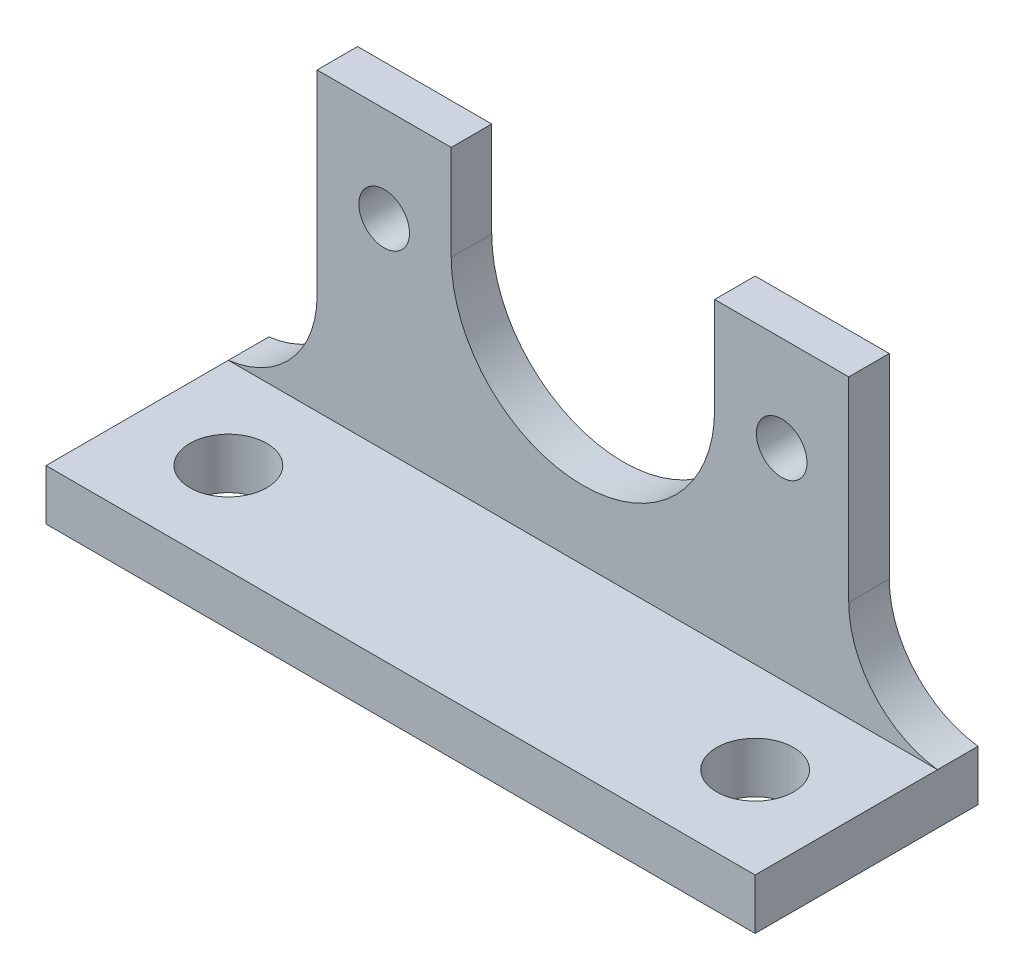
ISO-10303-21;
HEADER;
FILE_DESCRIPTION(('STEP AP214'),'2;1');
FILE_NAME('part.step','',(''),(''),'','','');
FILE_SCHEMA(('AUTOMOTIVE_DESIGN { 1 0 10303 214 1 1 1 1 }'));
ENDSEC;
DATA;
#1=APPLICATION_CONTEXT('core data for automotive mechanical design processes');
#2=APPLICATION_PROTOCOL_DEFINITION('international standard','automotive_design',2000,#1);
#3=PRODUCT_CONTEXT('',#1,'mechanical');
#4=PRODUCT('Part','Part','',(#3));
#5=PRODUCT_RELATED_PRODUCT_CATEGORY('part','',(#4));
#6=PRODUCT_DEFINITION_FORMATION('','',#4);
#7=PRODUCT_DEFINITION_CONTEXT('part definition',#1,'design');
#8=PRODUCT_DEFINITION('design','',#6,#7);
#9=PRODUCT_DEFINITION_SHAPE('','',#8);
#10=(LENGTH_UNIT() NAMED_UNIT(*) SI_UNIT(.MILLI.,.METRE.));
#11=(NAMED_UNIT(*) PLANE_ANGLE_UNIT() SI_UNIT($,.RADIAN.));
#12=(NAMED_UNIT(*) SI_UNIT($,.STERADIAN.) SOLID_ANGLE_UNIT());
#13=UNCERTAINTY_MEASURE_WITH_UNIT(LENGTH_MEASURE(1.E-05),#10,'distance_accuracy_value','');
#14=(GEOMETRIC_REPRESENTATION_CONTEXT(3) GLOBAL_UNCERTAINTY_ASSIGNED_CONTEXT((#13)) GLOBAL_UNIT_ASSIGNED_CONTEXT((#10,
#11,#12)) REPRESENTATION_CONTEXT('',''));
#15=CARTESIAN_POINT('',(0.,0.,0.));
#16=DIRECTION('',(0.,0.,1.));
#17=DIRECTION('',(1.,0.,0.));
#18=AXIS2_PLACEMENT_3D('',#15,#16,#17);
#19=CARTESIAN_POINT('',(0.,-5.23076923076924,2.54));
#20=DIRECTION('',(0.,0.,1.));
#21=DIRECTION('',(1.,0.,0.));
#22=AXIS2_PLACEMENT_3D('',#19,#20,#21);
#23=PLANE('',#22);
#24=DIRECTION('',(-1.,0.,0.));
#25=VECTOR('',#24,1.);
#26=CARTESIAN_POINT('',(0.,-17.8037692307692,2.54));
#27=LINE('',#26,#25);
#28=CARTESIAN_POINT('',(22.225,-17.8037692307692,2.54));
#29=VERTEX_POINT('',#28);
#30=CARTESIAN_POINT('',(-22.225,-17.8037692307692,2.54));
#31=VERTEX_POINT('',#30);
#32=EDGE_CURVE('E167',#29,#31,#27,.T.);
#33=ORIENTED_EDGE('',*,*,#32,.F.);
#34=CARTESIAN_POINT('',(23.0124,-11.502777146978,2.54));
#35=DIRECTION('',(0.,0.,1.));
#36=DIRECTION('',(1.,0.,0.));
#37=AXIS2_PLACEMENT_3D('',#34,#35,#36);
#38=CIRCLE('',#37,6.35);
#39=CARTESIAN_POINT('',(16.6624,-11.502777146978,2.54));
#40=VERTEX_POINT('',#39);
#41=EDGE_CURVE('E11',#29,#40,#38,.F.);
#42=ORIENTED_EDGE('',*,*,#41,.T.);
#43=DIRECTION('',(0.,1.,0.));
#44=VECTOR('',#43,1.);
#45=CARTESIAN_POINT('',(16.6624,-5.23076923076924,2.54));
#46=LINE('',#45,#44);
#47=CARTESIAN_POINT('',(16.6624,0.738461538461539,2.54));
#48=VERTEX_POINT('',#47);
#49=EDGE_CURVE('E199',#40,#48,#46,.T.);
#50=ORIENTED_EDGE('',*,*,#49,.T.);
#51=DIRECTION('',(-1.,0.,0.));
#52=VECTOR('',#51,1.);
#53=CARTESIAN_POINT('',(8.255,0.738461538461539,2.54));
#54=LINE('',#53,#52);
#55=CARTESIAN_POINT('',(8.255,0.738461538461539,2.54));
#56=VERTEX_POINT('',#55);
#57=EDGE_CURVE('E201',#48,#56,#54,.T.);
#58=ORIENTED_EDGE('',*,*,#57,.T.);
#59=DIRECTION('',(0.,-1.,0.));
#60=VECTOR('',#59,1.);
#61=CARTESIAN_POINT('',(8.255,-5.23076923076924,2.54));
#62=LINE('',#61,#60);
#63=CARTESIAN_POINT('',(8.255,-5.23076923076924,2.54));
#64=VERTEX_POINT('',#63);
#65=EDGE_CURVE('E203',#56,#64,#62,.T.);
#66=ORIENTED_EDGE('',*,*,#65,.T.);
#67=CARTESIAN_POINT('',(0.,-5.23076923076924,2.54));
#68=DIRECTION('',(0.,0.,-1.));
#69=DIRECTION('',(1.,0.,0.));
#70=AXIS2_PLACEMENT_3D('',#67,#68,#69);
#71=CIRCLE('',#70,8.255);
#72=CARTESIAN_POINT('',(-8.255,-5.23076923076924,2.54));
#73=VERTEX_POINT('',#72);
#74=EDGE_CURVE('E188',#64,#73,#71,.T.);
#75=ORIENTED_EDGE('',*,*,#74,.T.);
#76=DIRECTION('',(0.,1.,0.));
#77=VECTOR('',#76,1.);
#78=CARTESIAN_POINT('',(-8.255,-5.23076923076924,2.54));
#79=LINE('',#78,#77);
#80=CARTESIAN_POINT('',(-8.255,0.738461538461539,2.54));
#81=VERTEX_POINT('',#80);
#82=EDGE_CURVE('E191',#73,#81,#79,.T.);
#83=ORIENTED_EDGE('',*,*,#82,.T.);
#84=DIRECTION('',(-1.,0.,0.));
#85=VECTOR('',#84,1.);
#86=CARTESIAN_POINT('',(-8.255,0.738461538461539,2.54));
#87=LINE('',#86,#85);
#88=CARTESIAN_POINT('',(-16.6624,0.738461538461539,2.54));
#89=VERTEX_POINT('',#88);
#90=EDGE_CURVE('E194',#81,#89,#87,.T.);
#91=ORIENTED_EDGE('',*,*,#90,.T.);
#92=DIRECTION('',(0.,-1.,0.));
#93=VECTOR('',#92,1.);
#94=CARTESIAN_POINT('',(-16.6624,-5.23076923076924,2.54));
#95=LINE('',#94,#93);
#96=CARTESIAN_POINT('',(-16.6624,-11.502777146978,2.54));
#97=VERTEX_POINT('',#96);
#98=EDGE_CURVE('E196',#89,#97,#95,.T.);
#99=ORIENTED_EDGE('',*,*,#98,.T.);
#100=CARTESIAN_POINT('',(-23.0124,-11.502777146978,2.54));
#101=DIRECTION('',(0.,0.,1.));
#102=DIRECTION('',(1.,0.,0.));
#103=AXIS2_PLACEMENT_3D('',#100,#101,#102);
#104=CIRCLE('',#103,6.35);
#105=EDGE_CURVE('E245',#97,#31,#104,.F.);
#106=ORIENTED_EDGE('',*,*,#105,.T.);
#107=EDGE_LOOP('',(#33,#42,#50,#58,#66,#75,#83,#91,#99,#106));
#108=FACE_BOUND('',#107,.T.);
#109=CARTESIAN_POINT('',(-12.4587,-5.23076923076924,2.54));
#110=DIRECTION('',(0.,0.,1.));
#111=DIRECTION('',(1.,0.,0.));
#112=AXIS2_PLACEMENT_3D('',#109,#110,#111);
#113=CIRCLE('',#112,1.5875);
#114=CARTESIAN_POINT('',(-10.8712,-5.23076923076924,2.54));
#115=VERTEX_POINT('',#114);
#116=EDGE_CURVE('E182',#115,#115,#113,.T.);
#117=ORIENTED_EDGE('',*,*,#116,.F.);
#118=EDGE_LOOP('',(#117));
#119=FACE_BOUND('',#118,.T.);
#120=CARTESIAN_POINT('',(12.4587,-5.23076923076924,2.54));
#121=DIRECTION('',(0.,0.,1.));
#122=DIRECTION('',(-1.,0.,0.));
#123=AXIS2_PLACEMENT_3D('',#120,#121,#122);
#124=CIRCLE('',#123,1.5875);
#125=CARTESIAN_POINT('',(10.8712,-5.23076923076924,2.54));
#126=VERTEX_POINT('',#125);
#127=EDGE_CURVE('E176',#126,#126,#124,.T.);
#128=ORIENTED_EDGE('',*,*,#127,.F.);
#129=EDGE_LOOP('',(#128));
#130=FACE_BOUND('',#129,.T.);
#131=ADVANCED_FACE('F33',(#108,#119,#130),#23,.T.);
#132=CARTESIAN_POINT('',(0.,-5.23076923076924,0.));
#133=DIRECTION('',(0.,0.,1.));
#134=DIRECTION('',(1.,0.,0.));
#135=AXIS2_PLACEMENT_3D('',#132,#133,#134);
#136=PLANE('',#135);
#137=CARTESIAN_POINT('',(-12.4587,-5.23076923076924,0.));
#138=DIRECTION('',(0.,0.,1.));
#139=DIRECTION('',(1.,0.,0.));
#140=AXIS2_PLACEMENT_3D('',#137,#138,#139);
#141=CIRCLE('',#140,1.5875);
#142=CARTESIAN_POINT('',(-10.8712,-5.23076923076924,0.));
#143=VERTEX_POINT('',#142);
#144=EDGE_CURVE('E179',#143,#143,#141,.T.);
#145=ORIENTED_EDGE('',*,*,#144,.T.);
#146=EDGE_LOOP('',(#145));
#147=FACE_BOUND('',#146,.T.);
#148=DIRECTION('',(0.,1.,0.));
#149=VECTOR('',#148,1.);
#150=CARTESIAN_POINT('',(16.6624,-5.23076923076924,0.));
#151=LINE('',#150,#149);
#152=CARTESIAN_POINT('',(16.6624,-11.502777146978,0.));
#153=VERTEX_POINT('',#152);
#154=CARTESIAN_POINT('',(16.6624,0.738461538461539,0.));
#155=VERTEX_POINT('',#154);
#156=EDGE_CURVE('E218',#153,#155,#151,.T.);
#157=ORIENTED_EDGE('',*,*,#156,.F.);
#158=CARTESIAN_POINT('',(23.0124,-11.502777146978,0.));
#159=DIRECTION('',(0.,0.,1.));
#160=DIRECTION('',(1.,0.,0.));
#161=AXIS2_PLACEMENT_3D('',#158,#159,#160);
#162=CIRCLE('',#161,6.35);
#163=CARTESIAN_POINT('',(22.225,-17.8037692307692,0.));
#164=VERTEX_POINT('',#163);
#165=EDGE_CURVE('E41',#153,#164,#162,.T.);
#166=ORIENTED_EDGE('',*,*,#165,.T.);
#167=DIRECTION('',(0.,1.,0.));
#168=VECTOR('',#167,1.);
#169=CARTESIAN_POINT('',(22.225,-20.9787692307692,0.));
#170=LINE('',#169,#168);
#171=CARTESIAN_POINT('',(22.225,-20.9787692307692,0.));
#172=VERTEX_POINT('',#171);
#173=EDGE_CURVE('E137',#172,#164,#170,.T.);
#174=ORIENTED_EDGE('',*,*,#173,.F.);
#175=DIRECTION('',(1.,0.,0.));
#176=VECTOR('',#175,1.);
#177=CARTESIAN_POINT('',(-16.6624,-20.9787692307692,0.));
#178=LINE('',#177,#176);
#179=CARTESIAN_POINT('',(-22.225,-20.9787692307692,0.));
#180=VERTEX_POINT('',#179);
#181=EDGE_CURVE('E216',#180,#172,#178,.T.);
#182=ORIENTED_EDGE('',*,*,#181,.F.);
#183=DIRECTION('',(0.,-1.,0.));
#184=VECTOR('',#183,1.);
#185=CARTESIAN_POINT('',(-22.225,-20.9787692307692,0.));
#186=LINE('',#185,#184);
#187=CARTESIAN_POINT('',(-22.225,-17.8037692307692,0.));
#188=VERTEX_POINT('',#187);
#189=EDGE_CURVE('E134',#188,#180,#186,.T.);
#190=ORIENTED_EDGE('',*,*,#189,.F.);
#191=CARTESIAN_POINT('',(-23.0124,-11.502777146978,0.));
#192=DIRECTION('',(0.,0.,1.));
#193=DIRECTION('',(1.,0.,0.));
#194=AXIS2_PLACEMENT_3D('',#191,#192,#193);
#195=CIRCLE('',#194,6.35);
#196=CARTESIAN_POINT('',(-16.6624,-11.502777146978,0.));
#197=VERTEX_POINT('',#196);
#198=EDGE_CURVE('E248',#188,#197,#195,.T.);
#199=ORIENTED_EDGE('',*,*,#198,.T.);
#200=DIRECTION('',(0.,-1.,0.));
#201=VECTOR('',#200,1.);
#202=CARTESIAN_POINT('',(-16.6624,-5.23076923076924,0.));
#203=LINE('',#202,#201);
#204=CARTESIAN_POINT('',(-16.6624,0.738461538461539,0.));
#205=VERTEX_POINT('',#204);
#206=EDGE_CURVE('E213',#205,#197,#203,.T.);
#207=ORIENTED_EDGE('',*,*,#206,.F.);
#208=DIRECTION('',(-1.,0.,0.));
#209=VECTOR('',#208,1.);
#210=CARTESIAN_POINT('',(-8.255,0.738461538461539,0.));
#211=LINE('',#210,#209);
#212=CARTESIAN_POINT('',(-8.255,0.738461538461539,0.));
#213=VERTEX_POINT('',#212);
#214=EDGE_CURVE('E210',#213,#205,#211,.T.);
#215=ORIENTED_EDGE('',*,*,#214,.F.);
#216=DIRECTION('',(0.,1.,0.));
#217=VECTOR('',#216,1.);
#218=CARTESIAN_POINT('',(-8.255,-5.23076923076924,0.));
#219=LINE('',#218,#217);
#220=CARTESIAN_POINT('',(-8.255,-5.23076923076924,0.));
#221=VERTEX_POINT('',#220);
#222=EDGE_CURVE('E208',#221,#213,#219,.T.);
#223=ORIENTED_EDGE('',*,*,#222,.F.);
#224=CARTESIAN_POINT('',(0.,-5.23076923076924,0.));
#225=DIRECTION('',(0.,0.,-1.));
#226=DIRECTION('',(1.,0.,0.));
#227=AXIS2_PLACEMENT_3D('',#224,#225,#226);
#228=CIRCLE('',#227,8.255);
#229=CARTESIAN_POINT('',(8.255,-5.23076923076924,0.));
#230=VERTEX_POINT('',#229);
#231=EDGE_CURVE('E185',#230,#221,#228,.T.);
#232=ORIENTED_EDGE('',*,*,#231,.F.);
#233=DIRECTION('',(0.,-1.,0.));
#234=VECTOR('',#233,1.);
#235=CARTESIAN_POINT('',(8.255,-5.23076923076924,0.));
#236=LINE('',#235,#234);
#237=CARTESIAN_POINT('',(8.255,0.738461538461539,0.));
#238=VERTEX_POINT('',#237);
#239=EDGE_CURVE('E192',#238,#230,#236,.T.);
#240=ORIENTED_EDGE('',*,*,#239,.F.);
#241=DIRECTION('',(-1.,0.,0.));
#242=VECTOR('',#241,1.);
#243=CARTESIAN_POINT('',(8.255,0.738461538461539,0.));
#244=LINE('',#243,#242);
#245=EDGE_CURVE('E220',#155,#238,#244,.T.);
#246=ORIENTED_EDGE('',*,*,#245,.F.);
#247=EDGE_LOOP('',(#157,#166,#174,#182,#190,#199,#207,#215,#223,#232,#240,#246));
#248=FACE_BOUND('',#247,.T.);
#249=CARTESIAN_POINT('',(12.4587,-5.23076923076924,0.));
#250=DIRECTION('',(0.,0.,1.));
#251=DIRECTION('',(-1.,0.,0.));
#252=AXIS2_PLACEMENT_3D('',#249,#250,#251);
#253=CIRCLE('',#252,1.5875);
#254=CARTESIAN_POINT('',(10.8712,-5.23076923076924,0.));
#255=VERTEX_POINT('',#254);
#256=EDGE_CURVE('E175',#255,#255,#253,.T.);
#257=ORIENTED_EDGE('',*,*,#256,.T.);
#258=EDGE_LOOP('',(#257));
#259=FACE_BOUND('',#258,.T.);
#260=ADVANCED_FACE('F252',(#147,#248,#259),#136,.F.);
#261=CARTESIAN_POINT('',(0.,-5.23076923076924,2.54));
#262=DIRECTION('',(0.,0.,-1.));
#263=DIRECTION('',(-1.,0.,0.));
#264=AXIS2_PLACEMENT_3D('',#261,#262,#263);
#265=CYLINDRICAL_SURFACE('',#264,8.255);
#266=ORIENTED_EDGE('',*,*,#231,.T.);
#267=DIRECTION('',(0.,0.,-1.));
#268=VECTOR('',#267,1.);
#269=CARTESIAN_POINT('',(-8.255,-5.23076923076924,2.54));
#270=LINE('',#269,#268);
#271=EDGE_CURVE('E237',#73,#221,#270,.T.);
#272=ORIENTED_EDGE('',*,*,#271,.F.);
#273=ORIENTED_EDGE('',*,*,#74,.F.);
#274=DIRECTION('',(0.,0.,-1.));
#275=VECTOR('',#274,1.);
#276=CARTESIAN_POINT('',(8.255,-5.23076923076924,2.54));
#277=LINE('',#276,#275);
#278=EDGE_CURVE('E205',#64,#230,#277,.T.);
#279=ORIENTED_EDGE('',*,*,#278,.T.);
#280=EDGE_LOOP('',(#266,#272,#273,#279));
#281=FACE_BOUND('',#280,.T.);
#282=ADVANCED_FACE('F274',(#281),#265,.F.);
#283=CARTESIAN_POINT('',(-8.255,-5.23076923076924,2.54));
#284=DIRECTION('',(-1.,0.,0.));
#285=DIRECTION('',(0.,0.,1.));
#286=AXIS2_PLACEMENT_3D('',#283,#284,#285);
#287=PLANE('',#286);
#288=ORIENTED_EDGE('',*,*,#222,.T.);
#289=DIRECTION('',(0.,0.,-1.));
#290=VECTOR('',#289,1.);
#291=CARTESIAN_POINT('',(-8.255,0.738461538461539,2.54));
#292=LINE('',#291,#290);
#293=EDGE_CURVE('E234',#81,#213,#292,.T.);
#294=ORIENTED_EDGE('',*,*,#293,.F.);
#295=ORIENTED_EDGE('',*,*,#82,.F.);
#296=ORIENTED_EDGE('',*,*,#271,.T.);
#297=EDGE_LOOP('',(#288,#294,#295,#296));
#298=FACE_BOUND('',#297,.T.);
#299=ADVANCED_FACE('F279',(#298),#287,.F.);
#300=CARTESIAN_POINT('',(-8.255,0.738461538461539,2.54));
#301=DIRECTION('',(0.,-1.,0.));
#302=DIRECTION('',(0.,0.,-1.));
#303=AXIS2_PLACEMENT_3D('',#300,#301,#302);
#304=PLANE('',#303);
#305=ORIENTED_EDGE('',*,*,#214,.T.);
#306=DIRECTION('',(0.,0.,-1.));
#307=VECTOR('',#306,1.);
#308=CARTESIAN_POINT('',(-16.6624,0.738461538461539,2.54));
#309=LINE('',#308,#307);
#310=EDGE_CURVE('E231',#89,#205,#309,.T.);
#311=ORIENTED_EDGE('',*,*,#310,.F.);
#312=ORIENTED_EDGE('',*,*,#90,.F.);
#313=ORIENTED_EDGE('',*,*,#293,.T.);
#314=EDGE_LOOP('',(#305,#311,#312,#313));
#315=FACE_BOUND('',#314,.T.);
#316=ADVANCED_FACE('F282',(#315),#304,.F.);
#317=CARTESIAN_POINT('',(-16.6624,-5.23076923076924,2.54));
#318=DIRECTION('',(1.,0.,0.));
#319=DIRECTION('',(0.,1.,0.));
#320=AXIS2_PLACEMENT_3D('',#317,#318,#319);
#321=PLANE('',#320);
#322=ORIENTED_EDGE('',*,*,#206,.T.);
#323=DIRECTION('',(0.,0.,1.));
#324=VECTOR('',#323,1.);
#325=CARTESIAN_POINT('',(-16.6624,-11.502777146978,2.54));
#326=LINE('',#325,#324);
#327=EDGE_CURVE('E240',#197,#97,#326,.T.);
#328=ORIENTED_EDGE('',*,*,#327,.T.);
#329=ORIENTED_EDGE('',*,*,#98,.F.);
#330=ORIENTED_EDGE('',*,*,#310,.T.);
#331=EDGE_LOOP('',(#322,#328,#329,#330));
#332=FACE_BOUND('',#331,.T.);
#333=ADVANCED_FACE('F285',(#332),#321,.F.);
#334=CARTESIAN_POINT('',(-16.6624,-20.9787692307692,2.54));
#335=DIRECTION('',(0.,1.,0.));
#336=DIRECTION('',(0.,0.,1.));
#337=AXIS2_PLACEMENT_3D('',#334,#335,#336);
#338=PLANE('',#337);
#339=CARTESIAN_POINT('',(16.51,-20.9787692307692,8.255));
#340=DIRECTION('',(0.,1.,0.));
#341=DIRECTION('',(0.,0.,-1.));
#342=AXIS2_PLACEMENT_3D('',#339,#340,#341);
#343=CIRCLE('',#342,2.413);
#344=CARTESIAN_POINT('',(16.51,-20.9787692307692,5.842));
#345=VERTEX_POINT('',#344);
#346=EDGE_CURVE('E479',#345,#345,#343,.T.);
#347=ORIENTED_EDGE('',*,*,#346,.T.);
#348=EDGE_LOOP('',(#347));
#349=FACE_BOUND('',#348,.T.);
#350=CARTESIAN_POINT('',(-16.51,-20.9787692307692,8.255));
#351=DIRECTION('',(0.,1.,0.));
#352=DIRECTION('',(0.,0.,1.));
#353=AXIS2_PLACEMENT_3D('',#350,#351,#352);
#354=CIRCLE('',#353,2.413);
#355=CARTESIAN_POINT('',(-16.51,-20.9787692307692,10.668));
#356=VERTEX_POINT('',#355);
#357=EDGE_CURVE('E152',#356,#356,#354,.T.);
#358=ORIENTED_EDGE('',*,*,#357,.T.);
#359=EDGE_LOOP('',(#358));
#360=FACE_BOUND('',#359,.T.);
#361=DIRECTION('',(0.,0.,1.));
#362=VECTOR('',#361,1.);
#363=CARTESIAN_POINT('',(-22.225,-20.9787692307692,0.));
#364=LINE('',#363,#362);
#365=CARTESIAN_POINT('',(-22.225,-20.9787692307692,13.97));
#366=VERTEX_POINT('',#365);
#367=EDGE_CURVE('E127',#180,#366,#364,.T.);
#368=ORIENTED_EDGE('',*,*,#367,.F.);
#369=ORIENTED_EDGE('',*,*,#181,.T.);
#370=DIRECTION('',(0.,0.,1.));
#371=VECTOR('',#370,1.);
#372=CARTESIAN_POINT('',(22.225,-20.9787692307692,0.));
#373=LINE('',#372,#371);
#374=CARTESIAN_POINT('',(22.225,-20.9787692307692,13.97));
#375=VERTEX_POINT('',#374);
#376=EDGE_CURVE('E136',#172,#375,#373,.T.);
#377=ORIENTED_EDGE('',*,*,#376,.T.);
#378=DIRECTION('',(1.,0.,0.));
#379=VECTOR('',#378,1.);
#380=CARTESIAN_POINT('',(-22.225,-20.9787692307692,13.97));
#381=LINE('',#380,#379);
#382=EDGE_CURVE('E140',#366,#375,#381,.T.);
#383=ORIENTED_EDGE('',*,*,#382,.F.);
#384=EDGE_LOOP('',(#368,#369,#377,#383));
#385=FACE_BOUND('',#384,.T.);
#386=ADVANCED_FACE('F141',(#349,#360,#385),#338,.F.);
#387=CARTESIAN_POINT('',(16.6624,-5.23076923076924,2.54));
#388=DIRECTION('',(-1.,0.,0.));
#389=DIRECTION('',(0.,0.,1.));
#390=AXIS2_PLACEMENT_3D('',#387,#388,#389);
#391=PLANE('',#390);
#392=ORIENTED_EDGE('',*,*,#49,.F.);
#393=DIRECTION('',(0.,0.,-1.));
#394=VECTOR('',#393,1.);
#395=CARTESIAN_POINT('',(16.6624,-11.502777146978,2.54));
#396=LINE('',#395,#394);
#397=EDGE_CURVE('E243',#40,#153,#396,.T.);
#398=ORIENTED_EDGE('',*,*,#397,.T.);
#399=ORIENTED_EDGE('',*,*,#156,.T.);
#400=DIRECTION('',(0.,0.,-1.));
#401=VECTOR('',#400,1.);
#402=CARTESIAN_POINT('',(16.6624,0.738461538461539,2.54));
#403=LINE('',#402,#401);
#404=EDGE_CURVE('E228',#48,#155,#403,.T.);
#405=ORIENTED_EDGE('',*,*,#404,.F.);
#406=EDGE_LOOP('',(#392,#398,#399,#405));
#407=FACE_BOUND('',#406,.T.);
#408=ADVANCED_FACE('F258',(#407),#391,.F.);
#409=CARTESIAN_POINT('',(8.255,0.738461538461539,2.54));
#410=DIRECTION('',(0.,-1.,0.));
#411=DIRECTION('',(0.,0.,-1.));
#412=AXIS2_PLACEMENT_3D('',#409,#410,#411);
#413=PLANE('',#412);
#414=ORIENTED_EDGE('',*,*,#245,.T.);
#415=DIRECTION('',(0.,0.,-1.));
#416=VECTOR('',#415,1.);
#417=CARTESIAN_POINT('',(8.255,0.738461538461539,2.54));
#418=LINE('',#417,#416);
#419=EDGE_CURVE('E225',#56,#238,#418,.T.);
#420=ORIENTED_EDGE('',*,*,#419,.F.);
#421=ORIENTED_EDGE('',*,*,#57,.F.);
#422=ORIENTED_EDGE('',*,*,#404,.T.);
#423=EDGE_LOOP('',(#414,#420,#421,#422));
#424=FACE_BOUND('',#423,.T.);
#425=ADVANCED_FACE('F266',(#424),#413,.F.);
#426=CARTESIAN_POINT('',(8.255,-5.23076923076924,2.54));
#427=DIRECTION('',(1.,0.,0.));
#428=DIRECTION('',(0.,0.,-1.));
#429=AXIS2_PLACEMENT_3D('',#426,#427,#428);
#430=PLANE('',#429);
#431=ORIENTED_EDGE('',*,*,#239,.T.);
#432=ORIENTED_EDGE('',*,*,#278,.F.);
#433=ORIENTED_EDGE('',*,*,#65,.F.);
#434=ORIENTED_EDGE('',*,*,#419,.T.);
#435=EDGE_LOOP('',(#431,#432,#433,#434));
#436=FACE_BOUND('',#435,.T.);
#437=ADVANCED_FACE('F269',(#436),#430,.F.);
#438=CARTESIAN_POINT('',(-12.4587,-5.23076923076924,2.54));
#439=DIRECTION('',(0.,0.,-1.));
#440=DIRECTION('',(-1.,0.,0.));
#441=AXIS2_PLACEMENT_3D('',#438,#439,#440);
#442=CYLINDRICAL_SURFACE('',#441,1.5875);
#443=ORIENTED_EDGE('',*,*,#116,.T.);
#444=EDGE_LOOP('',(#443));
#445=FACE_BOUND('',#444,.T.);
#446=ORIENTED_EDGE('',*,*,#144,.F.);
#447=EDGE_LOOP('',(#446));
#448=FACE_BOUND('',#447,.T.);
#449=ADVANCED_FACE('F310',(#445,#448),#442,.F.);
#450=CARTESIAN_POINT('',(12.4587,-5.23076923076924,2.54));
#451=DIRECTION('',(0.,0.,-1.));
#452=DIRECTION('',(-1.,0.,0.));
#453=AXIS2_PLACEMENT_3D('',#450,#451,#452);
#454=CYLINDRICAL_SURFACE('',#453,1.5875);
#455=ORIENTED_EDGE('',*,*,#127,.T.);
#456=EDGE_LOOP('',(#455));
#457=FACE_BOUND('',#456,.T.);
#458=ORIENTED_EDGE('',*,*,#256,.F.);
#459=EDGE_LOOP('',(#458));
#460=FACE_BOUND('',#459,.T.);
#461=ADVANCED_FACE('F369',(#457,#460),#454,.F.);
#462=CARTESIAN_POINT('',(-22.225,-17.8037692307692,0.));
#463=DIRECTION('',(0.,1.,0.));
#464=DIRECTION('',(0.,0.,1.));
#465=AXIS2_PLACEMENT_3D('',#462,#463,#464);
#466=PLANE('',#465);
#467=CARTESIAN_POINT('',(16.51,-17.8037692307692,8.255));
#468=DIRECTION('',(0.,1.,0.));
#469=DIRECTION('',(0.,0.,-1.));
#470=AXIS2_PLACEMENT_3D('',#467,#468,#469);
#471=CIRCLE('',#470,2.413);
#472=CARTESIAN_POINT('',(16.51,-17.8037692307692,5.842));
#473=VERTEX_POINT('',#472);
#474=EDGE_CURVE('E481',#473,#473,#471,.T.);
#475=ORIENTED_EDGE('',*,*,#474,.F.);
#476=EDGE_LOOP('',(#475));
#477=FACE_BOUND('',#476,.T.);
#478=CARTESIAN_POINT('',(-16.51,-17.8037692307692,8.255));
#479=DIRECTION('',(0.,1.,0.));
#480=DIRECTION('',(0.,0.,1.));
#481=AXIS2_PLACEMENT_3D('',#478,#479,#480);
#482=CIRCLE('',#481,2.413);
#483=CARTESIAN_POINT('',(-16.51,-17.8037692307692,10.668));
#484=VERTEX_POINT('',#483);
#485=EDGE_CURVE('E155',#484,#484,#482,.T.);
#486=ORIENTED_EDGE('',*,*,#485,.F.);
#487=EDGE_LOOP('',(#486));
#488=FACE_BOUND('',#487,.T.);
#489=ORIENTED_EDGE('',*,*,#32,.T.);
#490=DIRECTION('',(0.,0.,1.));
#491=VECTOR('',#490,1.);
#492=CARTESIAN_POINT('',(-22.225,-17.8037692307692,0.));
#493=LINE('',#492,#491);
#494=CARTESIAN_POINT('',(-22.225,-17.8037692307692,13.97));
#495=VERTEX_POINT('',#494);
#496=EDGE_CURVE('E168',#31,#495,#493,.T.);
#497=ORIENTED_EDGE('',*,*,#496,.T.);
#498=DIRECTION('',(-1.,0.,0.));
#499=VECTOR('',#498,1.);
#500=CARTESIAN_POINT('',(-22.225,-17.8037692307692,13.97));
#501=LINE('',#500,#499);
#502=CARTESIAN_POINT('',(22.225,-17.8037692307692,13.97));
#503=VERTEX_POINT('',#502);
#504=EDGE_CURVE('E151',#503,#495,#501,.T.);
#505=ORIENTED_EDGE('',*,*,#504,.F.);
#506=DIRECTION('',(0.,0.,1.));
#507=VECTOR('',#506,1.);
#508=CARTESIAN_POINT('',(22.225,-17.8037692307692,0.));
#509=LINE('',#508,#507);
#510=EDGE_CURVE('E172',#29,#503,#509,.T.);
#511=ORIENTED_EDGE('',*,*,#510,.F.);
#512=EDGE_LOOP('',(#489,#497,#505,#511));
#513=FACE_BOUND('',#512,.T.);
#514=ADVANCED_FACE('F376',(#477,#488,#513),#466,.T.);
#515=CARTESIAN_POINT('',(-22.225,-20.9787692307692,0.));
#516=DIRECTION('',(-1.,0.,0.));
#517=DIRECTION('',(0.,0.,1.));
#518=AXIS2_PLACEMENT_3D('',#515,#516,#517);
#519=PLANE('',#518);
#520=ORIENTED_EDGE('',*,*,#367,.T.);
#521=DIRECTION('',(0.,-1.,0.));
#522=VECTOR('',#521,1.);
#523=CARTESIAN_POINT('',(-22.225,-20.9787692307692,13.97));
#524=LINE('',#523,#522);
#525=EDGE_CURVE('E132',#495,#366,#524,.T.);
#526=ORIENTED_EDGE('',*,*,#525,.F.);
#527=ORIENTED_EDGE('',*,*,#496,.F.);
#528=EDGE_CURVE('E164',#188,#31,#493,.T.);
#529=ORIENTED_EDGE('',*,*,#528,.F.);
#530=ORIENTED_EDGE('',*,*,#189,.T.);
#531=EDGE_LOOP('',(#520,#526,#527,#529,#530));
#532=FACE_BOUND('',#531,.T.);
#533=ADVANCED_FACE('F129',(#532),#519,.T.);
#534=CARTESIAN_POINT('',(22.225,-20.9787692307692,0.));
#535=DIRECTION('',(1.,0.,0.));
#536=DIRECTION('',(0.,0.,-1.));
#537=AXIS2_PLACEMENT_3D('',#534,#535,#536);
#538=PLANE('',#537);
#539=EDGE_CURVE('E169',#164,#29,#509,.T.);
#540=ORIENTED_EDGE('',*,*,#539,.T.);
#541=ORIENTED_EDGE('',*,*,#510,.T.);
#542=DIRECTION('',(0.,1.,0.));
#543=VECTOR('',#542,1.);
#544=CARTESIAN_POINT('',(22.225,-20.9787692307692,13.97));
#545=LINE('',#544,#543);
#546=EDGE_CURVE('E146',#375,#503,#545,.T.);
#547=ORIENTED_EDGE('',*,*,#546,.F.);
#548=ORIENTED_EDGE('',*,*,#376,.F.);
#549=ORIENTED_EDGE('',*,*,#173,.T.);
#550=EDGE_LOOP('',(#540,#541,#547,#548,#549));
#551=FACE_BOUND('',#550,.T.);
#552=ADVANCED_FACE('F256',(#551),#538,.T.);
#553=CARTESIAN_POINT('',(0.,0.,13.97));
#554=DIRECTION('',(0.,0.,-1.));
#555=DIRECTION('',(-1.,0.,0.));
#556=AXIS2_PLACEMENT_3D('',#553,#554,#555);
#557=PLANE('',#556);
#558=ORIENTED_EDGE('',*,*,#525,.T.);
#559=ORIENTED_EDGE('',*,*,#382,.T.);
#560=ORIENTED_EDGE('',*,*,#546,.T.);
#561=ORIENTED_EDGE('',*,*,#504,.T.);
#562=EDGE_LOOP('',(#558,#559,#560,#561));
#563=FACE_BOUND('',#562,.T.);
#564=ADVANCED_FACE('F149',(#563),#557,.F.);
#565=CARTESIAN_POINT('',(-16.51,-20.9787692307692,8.255));
#566=DIRECTION('',(0.,1.,0.));
#567=DIRECTION('',(0.,0.,1.));
#568=AXIS2_PLACEMENT_3D('',#565,#566,#567);
#569=CYLINDRICAL_SURFACE('',#568,2.413);
#570=ORIENTED_EDGE('',*,*,#357,.F.);
#571=EDGE_LOOP('',(#570));
#572=FACE_BOUND('',#571,.T.);
#573=ORIENTED_EDGE('',*,*,#485,.T.);
#574=EDGE_LOOP('',(#573));
#575=FACE_BOUND('',#574,.T.);
#576=ADVANCED_FACE('F298',(#572,#575),#569,.F.);
#577=CARTESIAN_POINT('',(16.51,-20.9787692307692,8.255));
#578=DIRECTION('',(0.,1.,0.));
#579=DIRECTION('',(0.,0.,1.));
#580=AXIS2_PLACEMENT_3D('',#577,#578,#579);
#581=CYLINDRICAL_SURFACE('',#580,2.413);
#582=ORIENTED_EDGE('',*,*,#346,.F.);
#583=EDGE_LOOP('',(#582));
#584=FACE_BOUND('',#583,.T.);
#585=ORIENTED_EDGE('',*,*,#474,.T.);
#586=EDGE_LOOP('',(#585));
#587=FACE_BOUND('',#586,.T.);
#588=ADVANCED_FACE('F293',(#584,#587),#581,.F.);
#589=CARTESIAN_POINT('',(-23.0124,-11.502777146978,0.));
#590=DIRECTION('',(0.,0.,1.));
#591=DIRECTION('',(1.,0.,0.));
#592=AXIS2_PLACEMENT_3D('',#589,#590,#591);
#593=CYLINDRICAL_SURFACE('',#592,6.35);
#594=ORIENTED_EDGE('',*,*,#198,.F.);
#595=ORIENTED_EDGE('',*,*,#528,.T.);
#596=ORIENTED_EDGE('',*,*,#105,.F.);
#597=ORIENTED_EDGE('',*,*,#327,.F.);
#598=EDGE_LOOP('',(#594,#595,#596,#597));
#599=FACE_BOUND('',#598,.T.);
#600=ADVANCED_FACE('F291',(#599),#593,.F.);
#601=CARTESIAN_POINT('',(23.0124,-11.502777146978,0.));
#602=DIRECTION('',(0.,0.,-1.));
#603=DIRECTION('',(-1.,0.,0.));
#604=AXIS2_PLACEMENT_3D('',#601,#602,#603);
#605=CYLINDRICAL_SURFACE('',#604,6.35);
#606=ORIENTED_EDGE('',*,*,#41,.F.);
#607=ORIENTED_EDGE('',*,*,#539,.F.);
#608=ORIENTED_EDGE('',*,*,#165,.F.);
#609=ORIENTED_EDGE('',*,*,#397,.F.);
#610=EDGE_LOOP('',(#606,#607,#608,#609));
#611=FACE_BOUND('',#610,.T.);
#612=ADVANCED_FACE('F35',(#611),#605,.F.);
#613=CLOSED_SHELL('',(#131,#260,#282,#299,#316,#333,#386,#408,#425,#437,#449,#461,#514,#533,
#552,#564,#576,#588,#600,#612));
#614=MANIFOLD_SOLID_BREP('B2',#613);
#615=ADVANCED_BREP_SHAPE_REPRESENTATION('',(#18,#614),#14);
#616=SHAPE_DEFINITION_REPRESENTATION(#9,#615);
ENDSEC;
END-ISO-10303-21;
